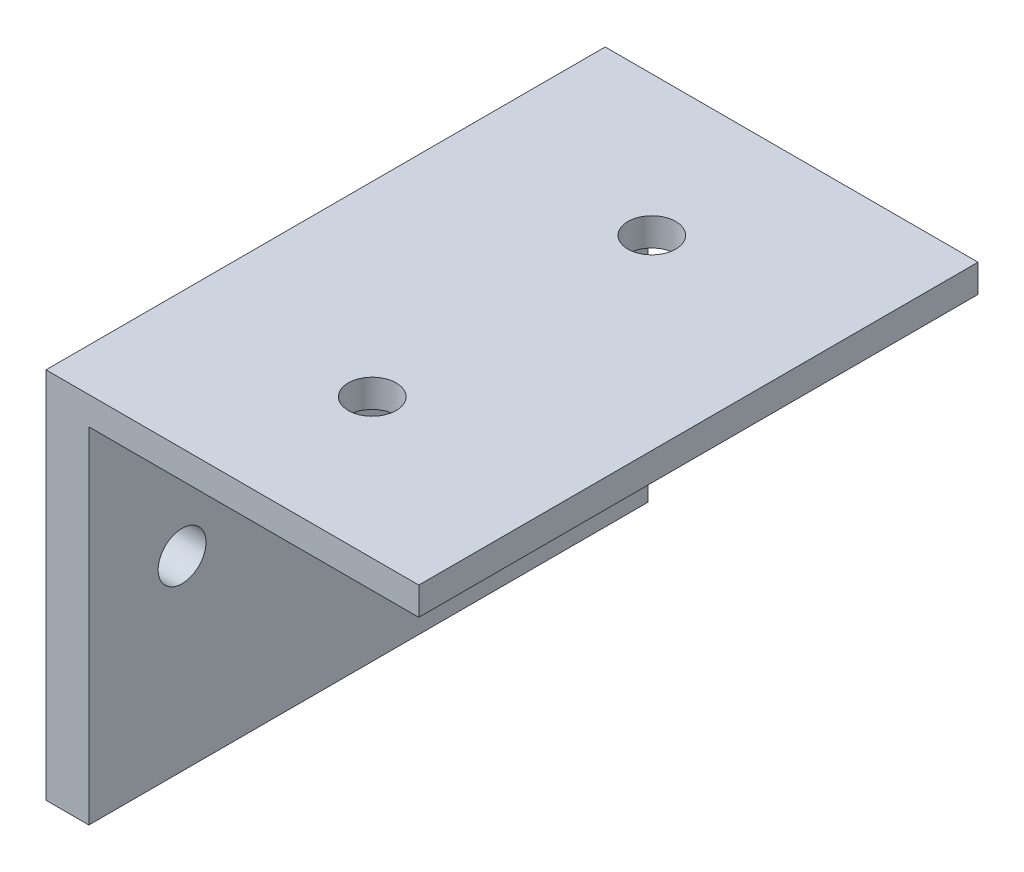
ISO-10303-21;
HEADER;
FILE_DESCRIPTION(('STEP AP214'),'2;1');
FILE_NAME('part.step','',(''),(''),'','','');
FILE_SCHEMA(('AUTOMOTIVE_DESIGN { 1 0 10303 214 1 1 1 1 }'));
ENDSEC;
DATA;
#1=APPLICATION_CONTEXT('core data for automotive mechanical design processes');
#2=APPLICATION_PROTOCOL_DEFINITION('international standard','automotive_design',2000,#1);
#3=PRODUCT_CONTEXT('',#1,'mechanical');
#4=PRODUCT('Part','Part','',(#3));
#5=PRODUCT_RELATED_PRODUCT_CATEGORY('part','',(#4));
#6=PRODUCT_DEFINITION_FORMATION('','',#4);
#7=PRODUCT_DEFINITION_CONTEXT('part definition',#1,'design');
#8=PRODUCT_DEFINITION('design','',#6,#7);
#9=PRODUCT_DEFINITION_SHAPE('','',#8);
#10=(LENGTH_UNIT() NAMED_UNIT(*) SI_UNIT(.MILLI.,.METRE.));
#11=(NAMED_UNIT(*) PLANE_ANGLE_UNIT() SI_UNIT($,.RADIAN.));
#12=(NAMED_UNIT(*) SI_UNIT($,.STERADIAN.) SOLID_ANGLE_UNIT());
#13=UNCERTAINTY_MEASURE_WITH_UNIT(LENGTH_MEASURE(1.E-05),#10,'distance_accuracy_value','');
#14=(GEOMETRIC_REPRESENTATION_CONTEXT(3) GLOBAL_UNCERTAINTY_ASSIGNED_CONTEXT((#13)) GLOBAL_UNIT_ASSIGNED_CONTEXT((#10,
#11,#12)) REPRESENTATION_CONTEXT('',''));
#15=CARTESIAN_POINT('',(0.,0.,0.));
#16=DIRECTION('',(0.,0.,1.));
#17=DIRECTION('',(1.,0.,0.));
#18=AXIS2_PLACEMENT_3D('',#15,#16,#17);
#19=CARTESIAN_POINT('',(0.,0.,76.2));
#20=DIRECTION('',(1.,0.,0.));
#21=DIRECTION('',(0.,0.,-1.));
#22=AXIS2_PLACEMENT_3D('',#19,#20,#21);
#23=PLANE('',#22);
#24=CARTESIAN_POINT('',(0.,25.4,12.7));
#25=DIRECTION('',(-1.,0.,0.));
#26=DIRECTION('',(0.,0.,1.));
#27=AXIS2_PLACEMENT_3D('',#24,#25,#26);
#28=CIRCLE('',#27,3.26389999999999);
#29=CARTESIAN_POINT('',(0.,25.4,15.9639));
#30=VERTEX_POINT('',#29);
#31=EDGE_CURVE('E157',#30,#30,#28,.T.);
#32=ORIENTED_EDGE('',*,*,#31,.F.);
#33=EDGE_LOOP('',(#32));
#34=FACE_BOUND('',#33,.T.);
#35=DIRECTION('',(0.,-1.,0.));
#36=VECTOR('',#35,1.);
#37=CARTESIAN_POINT('',(0.,0.,0.));
#38=LINE('',#37,#36);
#39=CARTESIAN_POINT('',(0.,50.8,0.));
#40=VERTEX_POINT('',#39);
#41=CARTESIAN_POINT('',(0.,0.,0.));
#42=VERTEX_POINT('',#41);
#43=EDGE_CURVE('E78',#40,#42,#38,.T.);
#44=ORIENTED_EDGE('',*,*,#43,.T.);
#45=DIRECTION('',(0.,0.,-1.));
#46=VECTOR('',#45,1.);
#47=CARTESIAN_POINT('',(0.,0.,76.2));
#48=LINE('',#47,#46);
#49=CARTESIAN_POINT('',(0.,0.,76.2));
#50=VERTEX_POINT('',#49);
#51=EDGE_CURVE('E114',#50,#42,#48,.T.);
#52=ORIENTED_EDGE('',*,*,#51,.F.);
#53=DIRECTION('',(0.,-1.,0.));
#54=VECTOR('',#53,1.);
#55=CARTESIAN_POINT('',(0.,0.,76.2));
#56=LINE('',#55,#54);
#57=CARTESIAN_POINT('',(0.,50.8,76.2));
#58=VERTEX_POINT('',#57);
#59=EDGE_CURVE('E49',#58,#50,#56,.T.);
#60=ORIENTED_EDGE('',*,*,#59,.F.);
#61=DIRECTION('',(0.,0.,-1.));
#62=VECTOR('',#61,1.);
#63=CARTESIAN_POINT('',(0.,50.8,76.2));
#64=LINE('',#63,#62);
#65=EDGE_CURVE('E109',#58,#40,#64,.T.);
#66=ORIENTED_EDGE('',*,*,#65,.T.);
#67=EDGE_LOOP('',(#44,#52,#60,#66));
#68=FACE_BOUND('',#67,.T.);
#69=CARTESIAN_POINT('',(0.,25.4,63.5));
#70=DIRECTION('',(-1.,0.,0.));
#71=DIRECTION('',(0.,0.,1.));
#72=AXIS2_PLACEMENT_3D('',#69,#70,#71);
#73=CIRCLE('',#72,3.26389999999999);
#74=CARTESIAN_POINT('',(0.,25.4,66.7639));
#75=VERTEX_POINT('',#74);
#76=EDGE_CURVE('E148',#75,#75,#73,.T.);
#77=ORIENTED_EDGE('',*,*,#76,.F.);
#78=EDGE_LOOP('',(#77));
#79=FACE_BOUND('',#78,.T.);
#80=ADVANCED_FACE('F32',(#34,#68,#79),#23,.F.);
#81=CARTESIAN_POINT('',(0.,50.8,76.2));
#82=DIRECTION('',(0.,-1.,0.));
#83=DIRECTION('',(0.,0.,-1.));
#84=AXIS2_PLACEMENT_3D('',#81,#82,#83);
#85=PLANE('',#84);
#86=CARTESIAN_POINT('',(25.4,50.8,19.05));
#87=DIRECTION('',(0.,1.,0.));
#88=DIRECTION('',(0.,0.,1.));
#89=AXIS2_PLACEMENT_3D('',#86,#87,#88);
#90=CIRCLE('',#89,3.26389999999999);
#91=CARTESIAN_POINT('',(25.4,50.8,22.3139));
#92=VERTEX_POINT('',#91);
#93=EDGE_CURVE('E154',#92,#92,#90,.T.);
#94=ORIENTED_EDGE('',*,*,#93,.F.);
#95=EDGE_LOOP('',(#94));
#96=FACE_BOUND('',#95,.T.);
#97=DIRECTION('',(-1.,0.,0.));
#98=VECTOR('',#97,1.);
#99=CARTESIAN_POINT('',(0.,50.8,0.));
#100=LINE('',#99,#98);
#101=CARTESIAN_POINT('',(50.8,50.8,0.));
#102=VERTEX_POINT('',#101);
#103=EDGE_CURVE('E72',#102,#40,#100,.T.);
#104=ORIENTED_EDGE('',*,*,#103,.T.);
#105=ORIENTED_EDGE('',*,*,#65,.F.);
#106=DIRECTION('',(-1.,0.,0.));
#107=VECTOR('',#106,1.);
#108=CARTESIAN_POINT('',(0.,50.8,76.2));
#109=LINE('',#108,#107);
#110=CARTESIAN_POINT('',(50.8,50.8,76.2));
#111=VERTEX_POINT('',#110);
#112=EDGE_CURVE('E97',#111,#58,#109,.T.);
#113=ORIENTED_EDGE('',*,*,#112,.F.);
#114=DIRECTION('',(0.,0.,-1.));
#115=VECTOR('',#114,1.);
#116=CARTESIAN_POINT('',(50.8,50.8,76.2));
#117=LINE('',#116,#115);
#118=EDGE_CURVE('E104',#111,#102,#117,.T.);
#119=ORIENTED_EDGE('',*,*,#118,.T.);
#120=EDGE_LOOP('',(#104,#105,#113,#119));
#121=FACE_BOUND('',#120,.T.);
#122=CARTESIAN_POINT('',(25.4,50.8,57.15));
#123=DIRECTION('',(0.,1.,0.));
#124=DIRECTION('',(0.,0.,1.));
#125=AXIS2_PLACEMENT_3D('',#122,#123,#124);
#126=CIRCLE('',#125,3.26389999999999);
#127=CARTESIAN_POINT('',(25.4,50.8,60.4139));
#128=VERTEX_POINT('',#127);
#129=EDGE_CURVE('E166',#128,#128,#126,.T.);
#130=ORIENTED_EDGE('',*,*,#129,.F.);
#131=EDGE_LOOP('',(#130));
#132=FACE_BOUND('',#131,.T.);
#133=ADVANCED_FACE('F111',(#96,#121,#132),#85,.F.);
#134=CARTESIAN_POINT('',(0.,0.,76.2));
#135=DIRECTION('',(0.,1.,0.));
#136=DIRECTION('',(0.,0.,1.));
#137=AXIS2_PLACEMENT_3D('',#134,#135,#136);
#138=PLANE('',#137);
#139=DIRECTION('',(1.,0.,0.));
#140=VECTOR('',#139,1.);
#141=CARTESIAN_POINT('',(0.,0.,0.));
#142=LINE('',#141,#140);
#143=CARTESIAN_POINT('',(5.842,0.,0.));
#144=VERTEX_POINT('',#143);
#145=EDGE_CURVE('E118',#42,#144,#142,.T.);
#146=ORIENTED_EDGE('',*,*,#145,.T.);
#147=DIRECTION('',(0.,0.,-1.));
#148=VECTOR('',#147,1.);
#149=CARTESIAN_POINT('',(5.842,0.,76.2));
#150=LINE('',#149,#148);
#151=CARTESIAN_POINT('',(5.842,0.,76.2));
#152=VERTEX_POINT('',#151);
#153=EDGE_CURVE('E11',#152,#144,#150,.T.);
#154=ORIENTED_EDGE('',*,*,#153,.F.);
#155=DIRECTION('',(1.,0.,0.));
#156=VECTOR('',#155,1.);
#157=CARTESIAN_POINT('',(0.,0.,76.2));
#158=LINE('',#157,#156);
#159=EDGE_CURVE('E129',#50,#152,#158,.T.);
#160=ORIENTED_EDGE('',*,*,#159,.F.);
#161=ORIENTED_EDGE('',*,*,#51,.T.);
#162=EDGE_LOOP('',(#146,#154,#160,#161));
#163=FACE_BOUND('',#162,.T.);
#164=ADVANCED_FACE('F34',(#163),#138,.F.);
#165=CARTESIAN_POINT('',(5.842,0.,76.2));
#166=DIRECTION('',(-1.,0.,0.));
#167=DIRECTION('',(0.,0.,1.));
#168=AXIS2_PLACEMENT_3D('',#165,#166,#167);
#169=PLANE('',#168);
#170=CARTESIAN_POINT('',(5.842,25.4,12.7));
#171=DIRECTION('',(-1.,0.,0.));
#172=DIRECTION('',(0.,0.,1.));
#173=AXIS2_PLACEMENT_3D('',#170,#171,#172);
#174=CIRCLE('',#173,3.2639);
#175=CARTESIAN_POINT('',(5.842,25.4,15.9639));
#176=VERTEX_POINT('',#175);
#177=EDGE_CURVE('E151',#176,#176,#174,.T.);
#178=ORIENTED_EDGE('',*,*,#177,.T.);
#179=EDGE_LOOP('',(#178));
#180=FACE_BOUND('',#179,.T.);
#181=CARTESIAN_POINT('',(5.842,25.4,63.5));
#182=DIRECTION('',(-1.,0.,0.));
#183=DIRECTION('',(0.,0.,1.));
#184=AXIS2_PLACEMENT_3D('',#181,#182,#183);
#185=CIRCLE('',#184,3.2639);
#186=CARTESIAN_POINT('',(5.842,25.4,66.7639));
#187=VERTEX_POINT('',#186);
#188=EDGE_CURVE('E150',#187,#187,#185,.T.);
#189=ORIENTED_EDGE('',*,*,#188,.T.);
#190=EDGE_LOOP('',(#189));
#191=FACE_BOUND('',#190,.T.);
#192=DIRECTION('',(0.,1.,0.));
#193=VECTOR('',#192,1.);
#194=CARTESIAN_POINT('',(5.842,0.,0.));
#195=LINE('',#194,#193);
#196=CARTESIAN_POINT('',(5.842,46.99,0.));
#197=VERTEX_POINT('',#196);
#198=EDGE_CURVE('E121',#144,#197,#195,.T.);
#199=ORIENTED_EDGE('',*,*,#198,.T.);
#200=DIRECTION('',(0.,0.,-1.));
#201=VECTOR('',#200,1.);
#202=CARTESIAN_POINT('',(5.842,46.99,76.2));
#203=LINE('',#202,#201);
#204=CARTESIAN_POINT('',(5.842,46.99,76.2));
#205=VERTEX_POINT('',#204);
#206=EDGE_CURVE('E41',#205,#197,#203,.T.);
#207=ORIENTED_EDGE('',*,*,#206,.F.);
#208=DIRECTION('',(0.,1.,0.));
#209=VECTOR('',#208,1.);
#210=CARTESIAN_POINT('',(5.842,0.,76.2));
#211=LINE('',#210,#209);
#212=EDGE_CURVE('E86',#152,#205,#211,.T.);
#213=ORIENTED_EDGE('',*,*,#212,.F.);
#214=ORIENTED_EDGE('',*,*,#153,.T.);
#215=EDGE_LOOP('',(#199,#207,#213,#214));
#216=FACE_BOUND('',#215,.T.);
#217=ADVANCED_FACE('F187',(#180,#191,#216),#169,.F.);
#218=CARTESIAN_POINT('',(5.842,46.99,76.2));
#219=DIRECTION('',(0.,1.,0.));
#220=DIRECTION('',(0.,0.,1.));
#221=AXIS2_PLACEMENT_3D('',#218,#219,#220);
#222=PLANE('',#221);
#223=CARTESIAN_POINT('',(25.4,46.99,19.05));
#224=DIRECTION('',(0.,1.,0.));
#225=DIRECTION('',(0.,0.,1.));
#226=AXIS2_PLACEMENT_3D('',#223,#224,#225);
#227=CIRCLE('',#226,3.2639);
#228=CARTESIAN_POINT('',(25.4,46.99,22.3139));
#229=VERTEX_POINT('',#228);
#230=EDGE_CURVE('E163',#229,#229,#227,.T.);
#231=ORIENTED_EDGE('',*,*,#230,.T.);
#232=EDGE_LOOP('',(#231));
#233=FACE_BOUND('',#232,.T.);
#234=CARTESIAN_POINT('',(25.4,46.99,57.15));
#235=DIRECTION('',(0.,1.,0.));
#236=DIRECTION('',(0.,0.,1.));
#237=AXIS2_PLACEMENT_3D('',#234,#235,#236);
#238=CIRCLE('',#237,3.2639);
#239=CARTESIAN_POINT('',(25.4,46.99,60.4139));
#240=VERTEX_POINT('',#239);
#241=EDGE_CURVE('E122',#240,#240,#238,.T.);
#242=ORIENTED_EDGE('',*,*,#241,.T.);
#243=EDGE_LOOP('',(#242));
#244=FACE_BOUND('',#243,.T.);
#245=DIRECTION('',(1.,0.,0.));
#246=VECTOR('',#245,1.);
#247=CARTESIAN_POINT('',(5.842,46.99,0.));
#248=LINE('',#247,#246);
#249=CARTESIAN_POINT('',(50.8,46.99,0.));
#250=VERTEX_POINT('',#249);
#251=EDGE_CURVE('E124',#197,#250,#248,.T.);
#252=ORIENTED_EDGE('',*,*,#251,.T.);
#253=DIRECTION('',(0.,0.,-1.));
#254=VECTOR('',#253,1.);
#255=CARTESIAN_POINT('',(50.8,46.99,76.2));
#256=LINE('',#255,#254);
#257=CARTESIAN_POINT('',(50.8,46.99,76.2));
#258=VERTEX_POINT('',#257);
#259=EDGE_CURVE('E108',#258,#250,#256,.T.);
#260=ORIENTED_EDGE('',*,*,#259,.F.);
#261=DIRECTION('',(1.,0.,0.));
#262=VECTOR('',#261,1.);
#263=CARTESIAN_POINT('',(5.842,46.99,76.2));
#264=LINE('',#263,#262);
#265=EDGE_CURVE('E99',#205,#258,#264,.T.);
#266=ORIENTED_EDGE('',*,*,#265,.F.);
#267=ORIENTED_EDGE('',*,*,#206,.T.);
#268=EDGE_LOOP('',(#252,#260,#266,#267));
#269=FACE_BOUND('',#268,.T.);
#270=ADVANCED_FACE('F135',(#233,#244,#269),#222,.F.);
#271=CARTESIAN_POINT('',(50.8,50.8,76.2));
#272=DIRECTION('',(-1.,0.,0.));
#273=DIRECTION('',(0.,0.,1.));
#274=AXIS2_PLACEMENT_3D('',#271,#272,#273);
#275=PLANE('',#274);
#276=DIRECTION('',(0.,1.,0.));
#277=VECTOR('',#276,1.);
#278=CARTESIAN_POINT('',(50.8,50.8,0.));
#279=LINE('',#278,#277);
#280=EDGE_CURVE('E107',#250,#102,#279,.T.);
#281=ORIENTED_EDGE('',*,*,#280,.T.);
#282=ORIENTED_EDGE('',*,*,#118,.F.);
#283=DIRECTION('',(0.,1.,0.));
#284=VECTOR('',#283,1.);
#285=CARTESIAN_POINT('',(50.8,50.8,76.2));
#286=LINE('',#285,#284);
#287=EDGE_CURVE('E93',#258,#111,#286,.T.);
#288=ORIENTED_EDGE('',*,*,#287,.F.);
#289=ORIENTED_EDGE('',*,*,#259,.T.);
#290=EDGE_LOOP('',(#281,#282,#288,#289));
#291=FACE_BOUND('',#290,.T.);
#292=ADVANCED_FACE('F105',(#291),#275,.F.);
#293=CARTESIAN_POINT('',(0.,0.,76.2));
#294=DIRECTION('',(0.,0.,1.));
#295=DIRECTION('',(1.,0.,0.));
#296=AXIS2_PLACEMENT_3D('',#293,#294,#295);
#297=PLANE('',#296);
#298=ORIENTED_EDGE('',*,*,#159,.T.);
#299=ORIENTED_EDGE('',*,*,#212,.T.);
#300=ORIENTED_EDGE('',*,*,#265,.T.);
#301=ORIENTED_EDGE('',*,*,#287,.T.);
#302=ORIENTED_EDGE('',*,*,#112,.T.);
#303=ORIENTED_EDGE('',*,*,#59,.T.);
#304=EDGE_LOOP('',(#298,#299,#300,#301,#302,#303));
#305=FACE_BOUND('',#304,.T.);
#306=ADVANCED_FACE('F95',(#305),#297,.T.);
#307=CARTESIAN_POINT('',(0.,0.,0.));
#308=DIRECTION('',(0.,0.,1.));
#309=DIRECTION('',(1.,0.,0.));
#310=AXIS2_PLACEMENT_3D('',#307,#308,#309);
#311=PLANE('',#310);
#312=ORIENTED_EDGE('',*,*,#145,.F.);
#313=ORIENTED_EDGE('',*,*,#43,.F.);
#314=ORIENTED_EDGE('',*,*,#103,.F.);
#315=ORIENTED_EDGE('',*,*,#280,.F.);
#316=ORIENTED_EDGE('',*,*,#251,.F.);
#317=ORIENTED_EDGE('',*,*,#198,.F.);
#318=EDGE_LOOP('',(#312,#313,#314,#315,#316,#317));
#319=FACE_BOUND('',#318,.T.);
#320=ADVANCED_FACE('F138',(#319),#311,.F.);
#321=CARTESIAN_POINT('',(25.4,50.8,57.15));
#322=DIRECTION('',(0.,1.,0.));
#323=DIRECTION('',(0.,0.,1.));
#324=AXIS2_PLACEMENT_3D('',#321,#322,#323);
#325=CYLINDRICAL_SURFACE('',#324,3.2639);
#326=ORIENTED_EDGE('',*,*,#241,.F.);
#327=EDGE_LOOP('',(#326));
#328=FACE_BOUND('',#327,.T.);
#329=ORIENTED_EDGE('',*,*,#129,.T.);
#330=EDGE_LOOP('',(#329));
#331=FACE_BOUND('',#330,.T.);
#332=ADVANCED_FACE('F175',(#328,#331),#325,.F.);
#333=CARTESIAN_POINT('',(25.4,50.8,19.05));
#334=DIRECTION('',(0.,1.,0.));
#335=DIRECTION('',(0.,0.,1.));
#336=AXIS2_PLACEMENT_3D('',#333,#334,#335);
#337=CYLINDRICAL_SURFACE('',#336,3.2639);
#338=ORIENTED_EDGE('',*,*,#230,.F.);
#339=EDGE_LOOP('',(#338));
#340=FACE_BOUND('',#339,.T.);
#341=ORIENTED_EDGE('',*,*,#93,.T.);
#342=EDGE_LOOP('',(#341));
#343=FACE_BOUND('',#342,.T.);
#344=ADVANCED_FACE('F178',(#340,#343),#337,.F.);
#345=CARTESIAN_POINT('',(0.,25.4,63.5));
#346=DIRECTION('',(-1.,0.,0.));
#347=DIRECTION('',(0.,0.,1.));
#348=AXIS2_PLACEMENT_3D('',#345,#346,#347);
#349=CYLINDRICAL_SURFACE('',#348,3.2639);
#350=ORIENTED_EDGE('',*,*,#188,.F.);
#351=EDGE_LOOP('',(#350));
#352=FACE_BOUND('',#351,.T.);
#353=ORIENTED_EDGE('',*,*,#76,.T.);
#354=EDGE_LOOP('',(#353));
#355=FACE_BOUND('',#354,.T.);
#356=ADVANCED_FACE('F203',(#352,#355),#349,.F.);
#357=CARTESIAN_POINT('',(0.,25.4,12.7));
#358=DIRECTION('',(-1.,0.,0.));
#359=DIRECTION('',(0.,0.,1.));
#360=AXIS2_PLACEMENT_3D('',#357,#358,#359);
#361=CYLINDRICAL_SURFACE('',#360,3.2639);
#362=ORIENTED_EDGE('',*,*,#177,.F.);
#363=EDGE_LOOP('',(#362));
#364=FACE_BOUND('',#363,.T.);
#365=ORIENTED_EDGE('',*,*,#31,.T.);
#366=EDGE_LOOP('',(#365));
#367=FACE_BOUND('',#366,.T.);
#368=ADVANCED_FACE('F205',(#364,#367),#361,.F.);
#369=CLOSED_SHELL('',(#80,#133,#164,#217,#270,#292,#306,#320,#332,#344,#356,#368));
#370=MANIFOLD_SOLID_BREP('B2',#369);
#371=ADVANCED_BREP_SHAPE_REPRESENTATION('',(#18,#370),#14);
#372=SHAPE_DEFINITION_REPRESENTATION(#9,#371);
ENDSEC;
END-ISO-10303-21;
